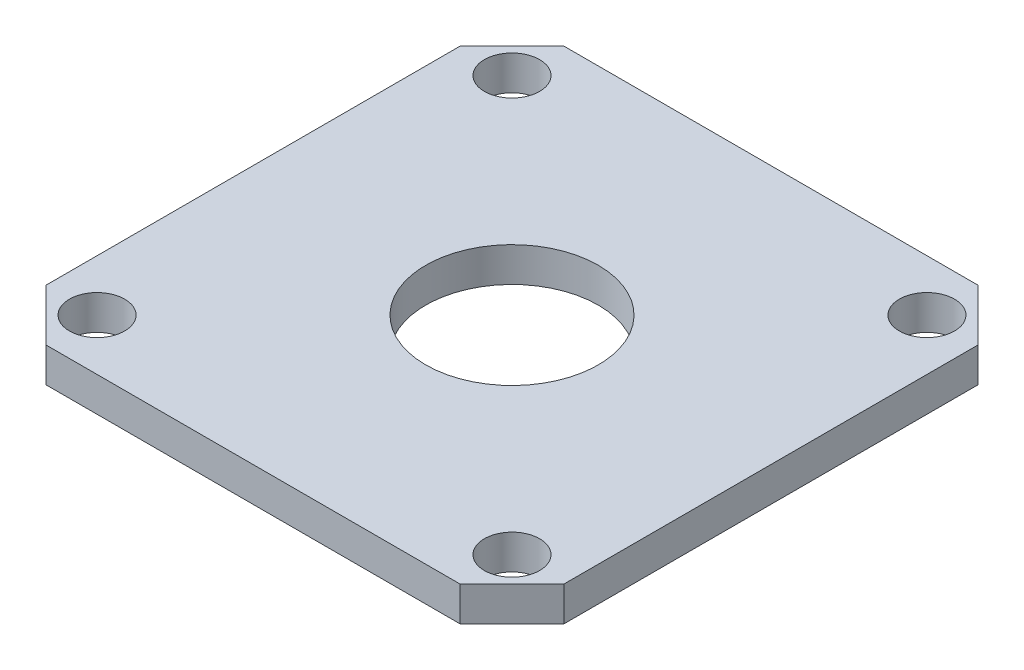
ISO-10303-21;
HEADER;
FILE_DESCRIPTION(('STEP AP214'),'2;1');
FILE_NAME('part.step','',(''),(''),'','','');
FILE_SCHEMA(('AUTOMOTIVE_DESIGN { 1 0 10303 214 1 1 1 1 }'));
ENDSEC;
DATA;
#1=APPLICATION_CONTEXT('core data for automotive mechanical design processes');
#2=APPLICATION_PROTOCOL_DEFINITION('international standard','automotive_design',2000,#1);
#3=PRODUCT_CONTEXT('',#1,'mechanical');
#4=PRODUCT('Part','Part','',(#3));
#5=PRODUCT_RELATED_PRODUCT_CATEGORY('part','',(#4));
#6=PRODUCT_DEFINITION_FORMATION('','',#4);
#7=PRODUCT_DEFINITION_CONTEXT('part definition',#1,'design');
#8=PRODUCT_DEFINITION('design','',#6,#7);
#9=PRODUCT_DEFINITION_SHAPE('','',#8);
#10=(LENGTH_UNIT() NAMED_UNIT(*) SI_UNIT(.MILLI.,.METRE.));
#11=(NAMED_UNIT(*) PLANE_ANGLE_UNIT() SI_UNIT($,.RADIAN.));
#12=(NAMED_UNIT(*) SI_UNIT($,.STERADIAN.) SOLID_ANGLE_UNIT());
#13=UNCERTAINTY_MEASURE_WITH_UNIT(LENGTH_MEASURE(1.E-05),#10,'distance_accuracy_value','');
#14=(GEOMETRIC_REPRESENTATION_CONTEXT(3) GLOBAL_UNCERTAINTY_ASSIGNED_CONTEXT((#13)) GLOBAL_UNIT_ASSIGNED_CONTEXT((#10,
#11,#12)) REPRESENTATION_CONTEXT('',''));
#15=CARTESIAN_POINT('',(0.,0.,0.));
#16=DIRECTION('',(0.,0.,1.));
#17=DIRECTION('',(1.,0.,0.));
#18=AXIS2_PLACEMENT_3D('',#15,#16,#17);
#19=CARTESIAN_POINT('',(12.,2.,15.));
#20=DIRECTION('',(0.707106781186547,0.,0.707106781186548));
#21=DIRECTION('',(0.,-1.,0.));
#22=AXIS2_PLACEMENT_3D('',#19,#20,#21);
#23=PLANE('',#22);
#24=DIRECTION('',(0.,1.,0.));
#25=VECTOR('',#24,1.);
#26=CARTESIAN_POINT('',(12.,0.,15.));
#27=LINE('',#26,#25);
#28=CARTESIAN_POINT('',(12.,0.,15.));
#29=VERTEX_POINT('',#28);
#30=CARTESIAN_POINT('',(12.,2.,15.));
#31=VERTEX_POINT('',#30);
#32=EDGE_CURVE('E196',#29,#31,#27,.T.);
#33=ORIENTED_EDGE('',*,*,#32,.F.);
#34=DIRECTION('',(-0.707106781186548,0.,0.707106781186547));
#35=VECTOR('',#34,1.);
#36=CARTESIAN_POINT('',(12.,0.,15.));
#37=LINE('',#36,#35);
#38=CARTESIAN_POINT('',(15.,0.,12.));
#39=VERTEX_POINT('',#38);
#40=EDGE_CURVE('E59',#39,#29,#37,.T.);
#41=ORIENTED_EDGE('',*,*,#40,.F.);
#42=DIRECTION('',(0.,-1.,0.));
#43=VECTOR('',#42,1.);
#44=CARTESIAN_POINT('',(15.,0.,12.));
#45=LINE('',#44,#43);
#46=CARTESIAN_POINT('',(15.,2.,12.));
#47=VERTEX_POINT('',#46);
#48=EDGE_CURVE('E139',#47,#39,#45,.T.);
#49=ORIENTED_EDGE('',*,*,#48,.F.);
#50=DIRECTION('',(0.707106781186548,0.,-0.707106781186547));
#51=VECTOR('',#50,1.);
#52=CARTESIAN_POINT('',(13.5,2.,13.5));
#53=LINE('',#52,#51);
#54=EDGE_CURVE('E13',#31,#47,#53,.T.);
#55=ORIENTED_EDGE('',*,*,#54,.F.);
#56=EDGE_LOOP('',(#33,#41,#49,#55));
#57=FACE_BOUND('',#56,.T.);
#58=ADVANCED_FACE('F51',(#57),#23,.T.);
#59=CARTESIAN_POINT('',(-15.,2.,12.));
#60=DIRECTION('',(0.707106781186547,0.,-0.707106781186547));
#61=DIRECTION('',(0.,1.,0.));
#62=AXIS2_PLACEMENT_3D('',#59,#60,#61);
#63=PLANE('',#62);
#64=DIRECTION('',(0.,1.,0.));
#65=VECTOR('',#64,1.);
#66=CARTESIAN_POINT('',(-15.,2.,12.));
#67=LINE('',#66,#65);
#68=CARTESIAN_POINT('',(-15.,0.,12.));
#69=VERTEX_POINT('',#68);
#70=CARTESIAN_POINT('',(-15.,2.,12.));
#71=VERTEX_POINT('',#70);
#72=EDGE_CURVE('E182',#69,#71,#67,.T.);
#73=ORIENTED_EDGE('',*,*,#72,.F.);
#74=DIRECTION('',(0.707106781186548,0.,0.707106781186548));
#75=VECTOR('',#74,1.);
#76=CARTESIAN_POINT('',(-15.,0.,12.));
#77=LINE('',#76,#75);
#78=CARTESIAN_POINT('',(-12.,0.,15.));
#79=VERTEX_POINT('',#78);
#80=EDGE_CURVE('E190',#79,#69,#77,.F.);
#81=ORIENTED_EDGE('',*,*,#80,.F.);
#82=DIRECTION('',(0.,-1.,0.));
#83=VECTOR('',#82,1.);
#84=CARTESIAN_POINT('',(-12.,2.,15.));
#85=LINE('',#84,#83);
#86=CARTESIAN_POINT('',(-12.,2.,15.));
#87=VERTEX_POINT('',#86);
#88=EDGE_CURVE('E186',#87,#79,#85,.T.);
#89=ORIENTED_EDGE('',*,*,#88,.F.);
#90=DIRECTION('',(-0.707106781186548,0.,-0.707106781186548));
#91=VECTOR('',#90,1.);
#92=CARTESIAN_POINT('',(-13.5,2.,13.5));
#93=LINE('',#92,#91);
#94=EDGE_CURVE('E193',#71,#87,#93,.F.);
#95=ORIENTED_EDGE('',*,*,#94,.F.);
#96=EDGE_LOOP('',(#73,#81,#89,#95));
#97=FACE_BOUND('',#96,.T.);
#98=ADVANCED_FACE('F210',(#97),#63,.F.);
#99=CARTESIAN_POINT('',(-12.,2.,-15.));
#100=DIRECTION('',(-0.707106781186547,0.,-0.707106781186548));
#101=DIRECTION('',(0.,-1.,0.));
#102=AXIS2_PLACEMENT_3D('',#99,#100,#101);
#103=PLANE('',#102);
#104=DIRECTION('',(0.,1.,0.));
#105=VECTOR('',#104,1.);
#106=CARTESIAN_POINT('',(-12.,0.,-15.));
#107=LINE('',#106,#105);
#108=CARTESIAN_POINT('',(-12.,0.,-15.));
#109=VERTEX_POINT('',#108);
#110=CARTESIAN_POINT('',(-12.,2.,-15.));
#111=VERTEX_POINT('',#110);
#112=EDGE_CURVE('E168',#109,#111,#107,.T.);
#113=ORIENTED_EDGE('',*,*,#112,.F.);
#114=DIRECTION('',(0.707106781186548,0.,-0.707106781186547));
#115=VECTOR('',#114,1.);
#116=CARTESIAN_POINT('',(-12.,0.,-15.));
#117=LINE('',#116,#115);
#118=CARTESIAN_POINT('',(-15.,0.,-12.));
#119=VERTEX_POINT('',#118);
#120=EDGE_CURVE('E176',#119,#109,#117,.T.);
#121=ORIENTED_EDGE('',*,*,#120,.F.);
#122=DIRECTION('',(0.,-1.,0.));
#123=VECTOR('',#122,1.);
#124=CARTESIAN_POINT('',(-15.,0.,-12.));
#125=LINE('',#124,#123);
#126=CARTESIAN_POINT('',(-15.,2.,-12.));
#127=VERTEX_POINT('',#126);
#128=EDGE_CURVE('E172',#127,#119,#125,.T.);
#129=ORIENTED_EDGE('',*,*,#128,.F.);
#130=DIRECTION('',(-0.707106781186548,0.,0.707106781186547));
#131=VECTOR('',#130,1.);
#132=CARTESIAN_POINT('',(-13.5,2.,-13.5));
#133=LINE('',#132,#131);
#134=EDGE_CURVE('E179',#111,#127,#133,.T.);
#135=ORIENTED_EDGE('',*,*,#134,.F.);
#136=EDGE_LOOP('',(#113,#121,#129,#135));
#137=FACE_BOUND('',#136,.T.);
#138=ADVANCED_FACE('F220',(#137),#103,.T.);
#139=CARTESIAN_POINT('',(15.,2.,-12.));
#140=DIRECTION('',(-0.707106781186547,0.,0.707106781186547));
#141=DIRECTION('',(0.,1.,0.));
#142=AXIS2_PLACEMENT_3D('',#139,#140,#141);
#143=PLANE('',#142);
#144=DIRECTION('',(0.,1.,0.));
#145=VECTOR('',#144,1.);
#146=CARTESIAN_POINT('',(15.,2.,-12.));
#147=LINE('',#146,#145);
#148=CARTESIAN_POINT('',(15.,0.,-12.));
#149=VERTEX_POINT('',#148);
#150=CARTESIAN_POINT('',(15.,2.,-12.));
#151=VERTEX_POINT('',#150);
#152=EDGE_CURVE('E130',#149,#151,#147,.T.);
#153=ORIENTED_EDGE('',*,*,#152,.F.);
#154=DIRECTION('',(-0.707106781186548,0.,-0.707106781186548));
#155=VECTOR('',#154,1.);
#156=CARTESIAN_POINT('',(15.,0.,-12.));
#157=LINE('',#156,#155);
#158=CARTESIAN_POINT('',(12.,0.,-15.));
#159=VERTEX_POINT('',#158);
#160=EDGE_CURVE('E114',#159,#149,#157,.F.);
#161=ORIENTED_EDGE('',*,*,#160,.F.);
#162=DIRECTION('',(0.,-1.,0.));
#163=VECTOR('',#162,1.);
#164=CARTESIAN_POINT('',(12.,2.,-15.));
#165=LINE('',#164,#163);
#166=CARTESIAN_POINT('',(12.,2.,-15.));
#167=VERTEX_POINT('',#166);
#168=EDGE_CURVE('E127',#167,#159,#165,.T.);
#169=ORIENTED_EDGE('',*,*,#168,.F.);
#170=DIRECTION('',(0.707106781186548,0.,0.707106781186548));
#171=VECTOR('',#170,1.);
#172=CARTESIAN_POINT('',(13.5,2.,-13.5));
#173=LINE('',#172,#171);
#174=EDGE_CURVE('E126',#151,#167,#173,.F.);
#175=ORIENTED_EDGE('',*,*,#174,.F.);
#176=EDGE_LOOP('',(#153,#161,#169,#175));
#177=FACE_BOUND('',#176,.T.);
#178=ADVANCED_FACE('F131',(#177),#143,.F.);
#179=CARTESIAN_POINT('',(15.,2.,0.));
#180=DIRECTION('',(1.,0.,0.));
#181=DIRECTION('',(0.,0.,-1.));
#182=AXIS2_PLACEMENT_3D('',#179,#180,#181);
#183=PLANE('',#182);
#184=DIRECTION('',(0.,0.,1.));
#185=VECTOR('',#184,1.);
#186=CARTESIAN_POINT('',(15.,2.,0.));
#187=LINE('',#186,#185);
#188=EDGE_CURVE('E226',#151,#47,#187,.T.);
#189=ORIENTED_EDGE('',*,*,#188,.T.);
#190=ORIENTED_EDGE('',*,*,#48,.T.);
#191=DIRECTION('',(0.,0.,1.));
#192=VECTOR('',#191,1.);
#193=CARTESIAN_POINT('',(15.,0.,0.));
#194=LINE('',#193,#192);
#195=EDGE_CURVE('E119',#149,#39,#194,.T.);
#196=ORIENTED_EDGE('',*,*,#195,.F.);
#197=ORIENTED_EDGE('',*,*,#152,.T.);
#198=EDGE_LOOP('',(#189,#190,#196,#197));
#199=FACE_BOUND('',#198,.T.);
#200=ADVANCED_FACE('F138',(#199),#183,.T.);
#201=CARTESIAN_POINT('',(0.,2.,-15.));
#202=DIRECTION('',(0.,0.,-1.));
#203=DIRECTION('',(-1.,0.,0.));
#204=AXIS2_PLACEMENT_3D('',#201,#202,#203);
#205=PLANE('',#204);
#206=DIRECTION('',(1.,0.,0.));
#207=VECTOR('',#206,1.);
#208=CARTESIAN_POINT('',(0.,0.,-15.));
#209=LINE('',#208,#207);
#210=EDGE_CURVE('E121',#109,#159,#209,.T.);
#211=ORIENTED_EDGE('',*,*,#210,.F.);
#212=ORIENTED_EDGE('',*,*,#112,.T.);
#213=DIRECTION('',(1.,0.,0.));
#214=VECTOR('',#213,1.);
#215=CARTESIAN_POINT('',(0.,2.,-15.));
#216=LINE('',#215,#214);
#217=EDGE_CURVE('E224',#111,#167,#216,.T.);
#218=ORIENTED_EDGE('',*,*,#217,.T.);
#219=ORIENTED_EDGE('',*,*,#168,.T.);
#220=EDGE_LOOP('',(#211,#212,#218,#219));
#221=FACE_BOUND('',#220,.T.);
#222=ADVANCED_FACE('F223',(#221),#205,.T.);
#223=CARTESIAN_POINT('',(-15.,2.,0.));
#224=DIRECTION('',(1.,0.,0.));
#225=DIRECTION('',(0.,0.,-1.));
#226=AXIS2_PLACEMENT_3D('',#223,#224,#225);
#227=PLANE('',#226);
#228=DIRECTION('',(0.,0.,1.));
#229=VECTOR('',#228,1.);
#230=CARTESIAN_POINT('',(-15.,0.,0.));
#231=LINE('',#230,#229);
#232=EDGE_CURVE('E145',#119,#69,#231,.T.);
#233=ORIENTED_EDGE('',*,*,#232,.T.);
#234=ORIENTED_EDGE('',*,*,#72,.T.);
#235=DIRECTION('',(0.,0.,1.));
#236=VECTOR('',#235,1.);
#237=CARTESIAN_POINT('',(-15.,2.,0.));
#238=LINE('',#237,#236);
#239=EDGE_CURVE('E218',#127,#71,#238,.T.);
#240=ORIENTED_EDGE('',*,*,#239,.F.);
#241=ORIENTED_EDGE('',*,*,#128,.T.);
#242=EDGE_LOOP('',(#233,#234,#240,#241));
#243=FACE_BOUND('',#242,.T.);
#244=ADVANCED_FACE('F214',(#243),#227,.F.);
#245=CARTESIAN_POINT('',(0.,2.,15.));
#246=DIRECTION('',(0.,0.,-1.));
#247=DIRECTION('',(-1.,0.,0.));
#248=AXIS2_PLACEMENT_3D('',#245,#246,#247);
#249=PLANE('',#248);
#250=DIRECTION('',(1.,0.,0.));
#251=VECTOR('',#250,1.);
#252=CARTESIAN_POINT('',(0.,0.,15.));
#253=LINE('',#252,#251);
#254=EDGE_CURVE('E155',#79,#29,#253,.T.);
#255=ORIENTED_EDGE('',*,*,#254,.T.);
#256=ORIENTED_EDGE('',*,*,#32,.T.);
#257=DIRECTION('',(1.,0.,0.));
#258=VECTOR('',#257,1.);
#259=CARTESIAN_POINT('',(0.,2.,15.));
#260=LINE('',#259,#258);
#261=EDGE_CURVE('E207',#87,#31,#260,.T.);
#262=ORIENTED_EDGE('',*,*,#261,.F.);
#263=ORIENTED_EDGE('',*,*,#88,.T.);
#264=EDGE_LOOP('',(#255,#256,#262,#263));
#265=FACE_BOUND('',#264,.T.);
#266=ADVANCED_FACE('F205',(#265),#249,.F.);
#267=CARTESIAN_POINT('',(-12.0208152801713,2.,-12.0208152801713));
#268=DIRECTION('',(0.,-1.,0.));
#269=DIRECTION('',(0.,0.,-1.));
#270=AXIS2_PLACEMENT_3D('',#267,#268,#269);
#271=CYLINDRICAL_SURFACE('',#270,1.6);
#272=CARTESIAN_POINT('',(-12.0208152801713,2.,-12.0208152801713));
#273=DIRECTION('',(0.,1.,0.));
#274=DIRECTION('',(0.,0.,1.));
#275=AXIS2_PLACEMENT_3D('',#272,#273,#274);
#276=CIRCLE('',#275,1.6);
#277=CARTESIAN_POINT('',(-12.0208152801713,2.,-10.4208152801713));
#278=VERTEX_POINT('',#277);
#279=EDGE_CURVE('E231',#278,#278,#276,.T.);
#280=ORIENTED_EDGE('',*,*,#279,.T.);
#281=EDGE_LOOP('',(#280));
#282=FACE_BOUND('',#281,.T.);
#283=CARTESIAN_POINT('',(-12.0208152801713,0.,-12.0208152801713));
#284=DIRECTION('',(0.,1.,0.));
#285=DIRECTION('',(0.,0.,1.));
#286=AXIS2_PLACEMENT_3D('',#283,#284,#285);
#287=CIRCLE('',#286,1.6);
#288=CARTESIAN_POINT('',(-12.0208152801713,0.,-10.4208152801713));
#289=VERTEX_POINT('',#288);
#290=EDGE_CURVE('E141',#289,#289,#287,.T.);
#291=ORIENTED_EDGE('',*,*,#290,.F.);
#292=EDGE_LOOP('',(#291));
#293=FACE_BOUND('',#292,.T.);
#294=ADVANCED_FACE('F263',(#282,#293),#271,.F.);
#295=CARTESIAN_POINT('',(12.0208152801713,2.,-12.0208152801713));
#296=DIRECTION('',(0.,-1.,0.));
#297=DIRECTION('',(0.,0.,-1.));
#298=AXIS2_PLACEMENT_3D('',#295,#296,#297);
#299=CYLINDRICAL_SURFACE('',#298,1.6);
#300=CARTESIAN_POINT('',(12.0208152801713,2.,-12.0208152801713));
#301=DIRECTION('',(0.,1.,0.));
#302=DIRECTION('',(0.,0.,1.));
#303=AXIS2_PLACEMENT_3D('',#300,#301,#302);
#304=CIRCLE('',#303,1.6);
#305=CARTESIAN_POINT('',(12.0208152801713,2.,-10.4208152801713));
#306=VERTEX_POINT('',#305);
#307=EDGE_CURVE('E235',#306,#306,#304,.F.);
#308=ORIENTED_EDGE('',*,*,#307,.F.);
#309=EDGE_LOOP('',(#308));
#310=FACE_BOUND('',#309,.T.);
#311=CARTESIAN_POINT('',(12.0208152801713,0.,-12.0208152801713));
#312=DIRECTION('',(0.,1.,0.));
#313=DIRECTION('',(0.,0.,1.));
#314=AXIS2_PLACEMENT_3D('',#311,#312,#313);
#315=CIRCLE('',#314,1.6);
#316=CARTESIAN_POINT('',(12.0208152801713,0.,-10.4208152801713));
#317=VERTEX_POINT('',#316);
#318=EDGE_CURVE('E148',#317,#317,#315,.F.);
#319=ORIENTED_EDGE('',*,*,#318,.T.);
#320=EDGE_LOOP('',(#319));
#321=FACE_BOUND('',#320,.T.);
#322=ADVANCED_FACE('F254',(#310,#321),#299,.F.);
#323=CARTESIAN_POINT('',(12.0208152801713,2.,12.0208152801713));
#324=DIRECTION('',(0.,-1.,0.));
#325=DIRECTION('',(0.,0.,-1.));
#326=AXIS2_PLACEMENT_3D('',#323,#324,#325);
#327=CYLINDRICAL_SURFACE('',#326,1.6);
#328=CARTESIAN_POINT('',(12.0208152801713,2.,12.0208152801713));
#329=DIRECTION('',(0.,1.,0.));
#330=DIRECTION('',(0.,0.,1.));
#331=AXIS2_PLACEMENT_3D('',#328,#329,#330);
#332=CIRCLE('',#331,1.6);
#333=CARTESIAN_POINT('',(12.0208152801713,2.,13.6208152801713));
#334=VERTEX_POINT('',#333);
#335=EDGE_CURVE('E162',#334,#334,#332,.T.);
#336=ORIENTED_EDGE('',*,*,#335,.T.);
#337=EDGE_LOOP('',(#336));
#338=FACE_BOUND('',#337,.T.);
#339=CARTESIAN_POINT('',(12.0208152801713,0.,12.0208152801713));
#340=DIRECTION('',(0.,1.,0.));
#341=DIRECTION('',(0.,0.,1.));
#342=AXIS2_PLACEMENT_3D('',#339,#340,#341);
#343=CIRCLE('',#342,1.6);
#344=CARTESIAN_POINT('',(12.0208152801713,0.,13.6208152801713));
#345=VERTEX_POINT('',#344);
#346=EDGE_CURVE('E246',#345,#345,#343,.T.);
#347=ORIENTED_EDGE('',*,*,#346,.F.);
#348=EDGE_LOOP('',(#347));
#349=FACE_BOUND('',#348,.T.);
#350=ADVANCED_FACE('F271',(#338,#349),#327,.F.);
#351=CARTESIAN_POINT('',(-12.0208152801713,2.,12.0208152801713));
#352=DIRECTION('',(0.,-1.,0.));
#353=DIRECTION('',(0.,0.,-1.));
#354=AXIS2_PLACEMENT_3D('',#351,#352,#353);
#355=CYLINDRICAL_SURFACE('',#354,1.6);
#356=CARTESIAN_POINT('',(-12.0208152801713,2.,12.0208152801713));
#357=DIRECTION('',(0.,1.,0.));
#358=DIRECTION('',(0.,0.,1.));
#359=AXIS2_PLACEMENT_3D('',#356,#357,#358);
#360=CIRCLE('',#359,1.6);
#361=CARTESIAN_POINT('',(-12.0208152801713,2.,13.6208152801713));
#362=VERTEX_POINT('',#361);
#363=EDGE_CURVE('E136',#362,#362,#360,.F.);
#364=ORIENTED_EDGE('',*,*,#363,.F.);
#365=EDGE_LOOP('',(#364));
#366=FACE_BOUND('',#365,.T.);
#367=CARTESIAN_POINT('',(-12.0208152801713,0.,12.0208152801713));
#368=DIRECTION('',(0.,1.,0.));
#369=DIRECTION('',(0.,0.,1.));
#370=AXIS2_PLACEMENT_3D('',#367,#368,#369);
#371=CIRCLE('',#370,1.6);
#372=CARTESIAN_POINT('',(-12.0208152801713,0.,13.6208152801713));
#373=VERTEX_POINT('',#372);
#374=EDGE_CURVE('E159',#373,#373,#371,.F.);
#375=ORIENTED_EDGE('',*,*,#374,.T.);
#376=EDGE_LOOP('',(#375));
#377=FACE_BOUND('',#376,.T.);
#378=ADVANCED_FACE('F288',(#366,#377),#355,.F.);
#379=CARTESIAN_POINT('',(0.,2.,0.));
#380=DIRECTION('',(0.,1.,0.));
#381=DIRECTION('',(0.,0.,1.));
#382=AXIS2_PLACEMENT_3D('',#379,#380,#381);
#383=PLANE('',#382);
#384=ORIENTED_EDGE('',*,*,#335,.F.);
#385=EDGE_LOOP('',(#384));
#386=FACE_BOUND('',#385,.T.);
#387=ORIENTED_EDGE('',*,*,#307,.T.);
#388=EDGE_LOOP('',(#387));
#389=FACE_BOUND('',#388,.T.);
#390=ORIENTED_EDGE('',*,*,#279,.F.);
#391=EDGE_LOOP('',(#390));
#392=FACE_BOUND('',#391,.T.);
#393=ORIENTED_EDGE('',*,*,#261,.T.);
#394=ORIENTED_EDGE('',*,*,#54,.T.);
#395=ORIENTED_EDGE('',*,*,#188,.F.);
#396=ORIENTED_EDGE('',*,*,#174,.T.);
#397=ORIENTED_EDGE('',*,*,#217,.F.);
#398=ORIENTED_EDGE('',*,*,#134,.T.);
#399=ORIENTED_EDGE('',*,*,#239,.T.);
#400=ORIENTED_EDGE('',*,*,#94,.T.);
#401=EDGE_LOOP('',(#393,#394,#395,#396,#397,#398,#399,#400));
#402=FACE_BOUND('',#401,.T.);
#403=ORIENTED_EDGE('',*,*,#363,.T.);
#404=EDGE_LOOP('',(#403));
#405=FACE_BOUND('',#404,.T.);
#406=CARTESIAN_POINT('',(0.,2.,0.));
#407=DIRECTION('',(0.,1.,0.));
#408=DIRECTION('',(0.,0.,1.));
#409=AXIS2_PLACEMENT_3D('',#406,#407,#408);
#410=CIRCLE('',#409,5.);
#411=CARTESIAN_POINT('',(0.,2.,5.));
#412=VERTEX_POINT('',#411);
#413=EDGE_CURVE('E305',#412,#412,#410,.T.);
#414=ORIENTED_EDGE('',*,*,#413,.F.);
#415=EDGE_LOOP('',(#414));
#416=FACE_BOUND('',#415,.T.);
#417=ADVANCED_FACE('F228',(#386,#389,#392,#402,#405,#416),#383,.T.);
#418=CARTESIAN_POINT('',(0.,0.,0.));
#419=DIRECTION('',(0.,1.,0.));
#420=DIRECTION('',(0.,0.,1.));
#421=AXIS2_PLACEMENT_3D('',#418,#419,#420);
#422=PLANE('',#421);
#423=ORIENTED_EDGE('',*,*,#346,.T.);
#424=EDGE_LOOP('',(#423));
#425=FACE_BOUND('',#424,.T.);
#426=ORIENTED_EDGE('',*,*,#318,.F.);
#427=EDGE_LOOP('',(#426));
#428=FACE_BOUND('',#427,.T.);
#429=ORIENTED_EDGE('',*,*,#290,.T.);
#430=EDGE_LOOP('',(#429));
#431=FACE_BOUND('',#430,.T.);
#432=ORIENTED_EDGE('',*,*,#195,.T.);
#433=ORIENTED_EDGE('',*,*,#40,.T.);
#434=ORIENTED_EDGE('',*,*,#254,.F.);
#435=ORIENTED_EDGE('',*,*,#80,.T.);
#436=ORIENTED_EDGE('',*,*,#232,.F.);
#437=ORIENTED_EDGE('',*,*,#120,.T.);
#438=ORIENTED_EDGE('',*,*,#210,.T.);
#439=ORIENTED_EDGE('',*,*,#160,.T.);
#440=EDGE_LOOP('',(#432,#433,#434,#435,#436,#437,#438,#439));
#441=FACE_BOUND('',#440,.T.);
#442=ORIENTED_EDGE('',*,*,#374,.F.);
#443=EDGE_LOOP('',(#442));
#444=FACE_BOUND('',#443,.T.);
#445=CARTESIAN_POINT('',(0.,0.,0.));
#446=DIRECTION('',(0.,1.,0.));
#447=DIRECTION('',(0.,0.,1.));
#448=AXIS2_PLACEMENT_3D('',#445,#446,#447);
#449=CIRCLE('',#448,5.);
#450=CARTESIAN_POINT('',(0.,0.,5.));
#451=VERTEX_POINT('',#450);
#452=EDGE_CURVE('E249',#451,#451,#449,.T.);
#453=ORIENTED_EDGE('',*,*,#452,.T.);
#454=EDGE_LOOP('',(#453));
#455=FACE_BOUND('',#454,.T.);
#456=ADVANCED_FACE('F116',(#425,#428,#431,#441,#444,#455),#422,.F.);
#457=CARTESIAN_POINT('',(0.,35.9411254969543,0.));
#458=DIRECTION('',(0.,-1.,0.));
#459=DIRECTION('',(0.,0.,-1.));
#460=AXIS2_PLACEMENT_3D('',#457,#458,#459);
#461=CYLINDRICAL_SURFACE('',#460,5.);
#462=ORIENTED_EDGE('',*,*,#452,.F.);
#463=EDGE_LOOP('',(#462));
#464=FACE_BOUND('',#463,.T.);
#465=ORIENTED_EDGE('',*,*,#413,.T.);
#466=EDGE_LOOP('',(#465));
#467=FACE_BOUND('',#466,.T.);
#468=ADVANCED_FACE('F258',(#464,#467),#461,.F.);
#469=CLOSED_SHELL('',(#58,#98,#138,#178,#200,#222,#244,#266,#294,#322,#350,#378,#417,#456,#468));
#470=MANIFOLD_SOLID_BREP('B2',#469);
#471=ADVANCED_BREP_SHAPE_REPRESENTATION('',(#18,#470),#14);
#472=SHAPE_DEFINITION_REPRESENTATION(#9,#471);
ENDSEC;
END-ISO-10303-21;
